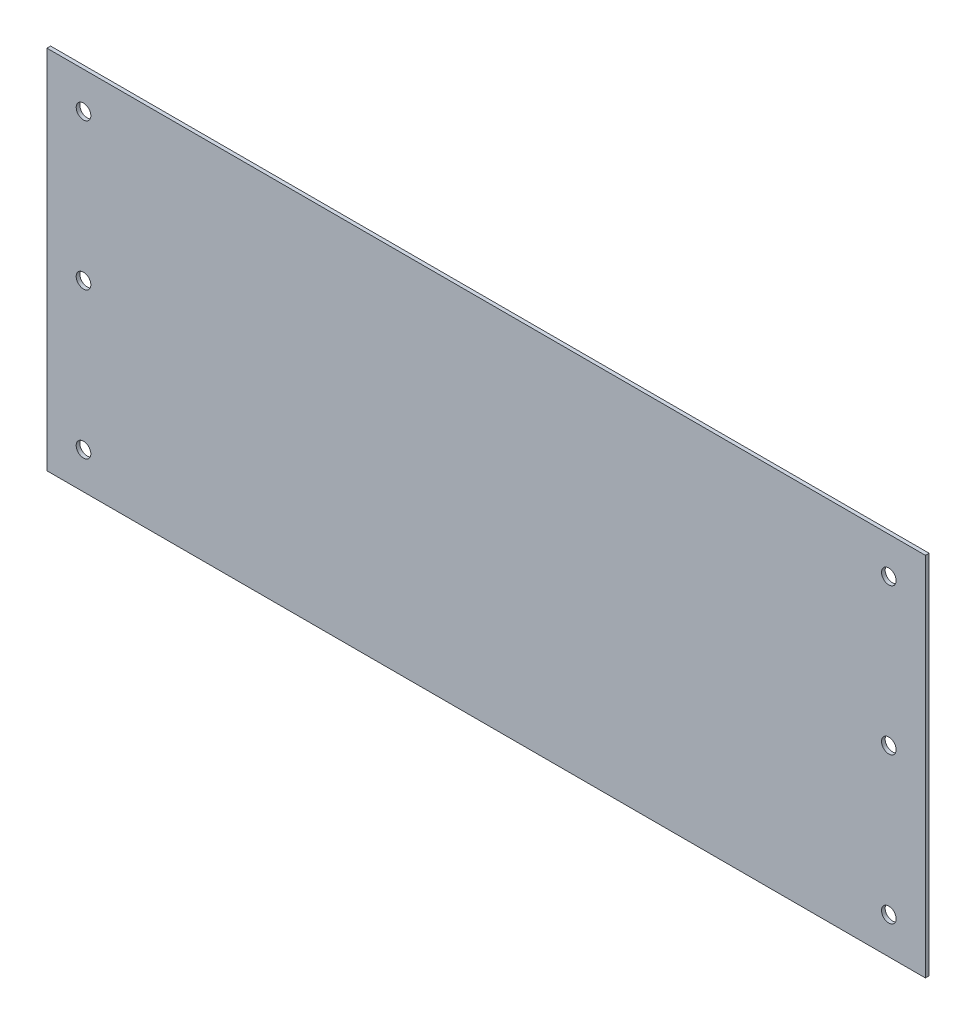
ISO-10303-21;
HEADER;
FILE_DESCRIPTION(('STEP AP214'),'2;1');
FILE_NAME('part.step','',(''),(''),'','','');
FILE_SCHEMA(('AUTOMOTIVE_DESIGN { 1 0 10303 214 1 1 1 1 }'));
ENDSEC;
DATA;
#1=APPLICATION_CONTEXT('core data for automotive mechanical design processes');
#2=APPLICATION_PROTOCOL_DEFINITION('international standard','automotive_design',2000,#1);
#3=PRODUCT_CONTEXT('',#1,'mechanical');
#4=PRODUCT('Part','Part','',(#3));
#5=PRODUCT_RELATED_PRODUCT_CATEGORY('part','',(#4));
#6=PRODUCT_DEFINITION_FORMATION('','',#4);
#7=PRODUCT_DEFINITION_CONTEXT('part definition',#1,'design');
#8=PRODUCT_DEFINITION('design','',#6,#7);
#9=PRODUCT_DEFINITION_SHAPE('','',#8);
#10=(LENGTH_UNIT() NAMED_UNIT(*) SI_UNIT(.MILLI.,.METRE.));
#11=(NAMED_UNIT(*) PLANE_ANGLE_UNIT() SI_UNIT($,.RADIAN.));
#12=(NAMED_UNIT(*) SI_UNIT($,.STERADIAN.) SOLID_ANGLE_UNIT());
#13=UNCERTAINTY_MEASURE_WITH_UNIT(LENGTH_MEASURE(1.E-05),#10,'distance_accuracy_value','');
#14=(GEOMETRIC_REPRESENTATION_CONTEXT(3) GLOBAL_UNCERTAINTY_ASSIGNED_CONTEXT((#13)) GLOBAL_UNIT_ASSIGNED_CONTEXT((#10,
#11,#12)) REPRESENTATION_CONTEXT('',''));
#15=CARTESIAN_POINT('',(0.,0.,0.));
#16=DIRECTION('',(0.,0.,1.));
#17=DIRECTION('',(1.,0.,0.));
#18=AXIS2_PLACEMENT_3D('',#15,#16,#17);
#19=CARTESIAN_POINT('',(-220.,100.,1.));
#20=DIRECTION('',(1.,0.,0.));
#21=DIRECTION('',(0.,0.,-1.));
#22=AXIS2_PLACEMENT_3D('',#19,#20,#21);
#23=PLANE('',#22);
#24=DIRECTION('',(0.,-1.,0.));
#25=VECTOR('',#24,1.);
#26=CARTESIAN_POINT('',(-220.,100.,0.));
#27=LINE('',#26,#25);
#28=CARTESIAN_POINT('',(-220.,100.,0.));
#29=VERTEX_POINT('',#28);
#30=CARTESIAN_POINT('',(-220.,0.,0.));
#31=VERTEX_POINT('',#30);
#32=EDGE_CURVE('E104',#29,#31,#27,.T.);
#33=ORIENTED_EDGE('',*,*,#32,.T.);
#34=DIRECTION('',(0.,0.,-1.));
#35=VECTOR('',#34,1.);
#36=CARTESIAN_POINT('',(-220.,0.,1.));
#37=LINE('',#36,#35);
#38=CARTESIAN_POINT('',(-220.,0.,1.));
#39=VERTEX_POINT('',#38);
#40=EDGE_CURVE('E11',#39,#31,#37,.T.);
#41=ORIENTED_EDGE('',*,*,#40,.F.);
#42=DIRECTION('',(0.,-1.,0.));
#43=VECTOR('',#42,1.);
#44=CARTESIAN_POINT('',(-220.,100.,1.));
#45=LINE('',#44,#43);
#46=CARTESIAN_POINT('',(-220.,100.,1.));
#47=VERTEX_POINT('',#46);
#48=EDGE_CURVE('E92',#47,#39,#45,.T.);
#49=ORIENTED_EDGE('',*,*,#48,.F.);
#50=DIRECTION('',(0.,0.,-1.));
#51=VECTOR('',#50,1.);
#52=CARTESIAN_POINT('',(-220.,100.,1.));
#53=LINE('',#52,#51);
#54=EDGE_CURVE('E100',#47,#29,#53,.T.);
#55=ORIENTED_EDGE('',*,*,#54,.T.);
#56=EDGE_LOOP('',(#33,#41,#49,#55));
#57=FACE_BOUND('',#56,.T.);
#58=ADVANCED_FACE('F41',(#57),#23,.F.);
#59=CARTESIAN_POINT('',(-220.,0.,1.));
#60=DIRECTION('',(0.,1.,0.));
#61=DIRECTION('',(0.,0.,1.));
#62=AXIS2_PLACEMENT_3D('',#59,#60,#61);
#63=PLANE('',#62);
#64=DIRECTION('',(1.,0.,0.));
#65=VECTOR('',#64,1.);
#66=CARTESIAN_POINT('',(-220.,0.,0.));
#67=LINE('',#66,#65);
#68=CARTESIAN_POINT('',(20.,0.,0.));
#69=VERTEX_POINT('',#68);
#70=EDGE_CURVE('E96',#31,#69,#67,.T.);
#71=ORIENTED_EDGE('',*,*,#70,.T.);
#72=DIRECTION('',(0.,0.,-1.));
#73=VECTOR('',#72,1.);
#74=CARTESIAN_POINT('',(20.,0.,1.));
#75=LINE('',#74,#73);
#76=CARTESIAN_POINT('',(20.,0.,1.));
#77=VERTEX_POINT('',#76);
#78=EDGE_CURVE('E49',#77,#69,#75,.T.);
#79=ORIENTED_EDGE('',*,*,#78,.F.);
#80=DIRECTION('',(1.,0.,0.));
#81=VECTOR('',#80,1.);
#82=CARTESIAN_POINT('',(-220.,0.,1.));
#83=LINE('',#82,#81);
#84=EDGE_CURVE('E87',#39,#77,#83,.T.);
#85=ORIENTED_EDGE('',*,*,#84,.F.);
#86=ORIENTED_EDGE('',*,*,#40,.T.);
#87=EDGE_LOOP('',(#71,#79,#85,#86));
#88=FACE_BOUND('',#87,.T.);
#89=ADVANCED_FACE('F95',(#88),#63,.F.);
#90=CARTESIAN_POINT('',(20.,100.,1.));
#91=DIRECTION('',(-1.,0.,0.));
#92=DIRECTION('',(0.,0.,1.));
#93=AXIS2_PLACEMENT_3D('',#90,#91,#92);
#94=PLANE('',#93);
#95=DIRECTION('',(0.,1.,0.));
#96=VECTOR('',#95,1.);
#97=CARTESIAN_POINT('',(20.,100.,0.));
#98=LINE('',#97,#96);
#99=CARTESIAN_POINT('',(20.,100.,0.));
#100=VERTEX_POINT('',#99);
#101=EDGE_CURVE('E74',#69,#100,#98,.T.);
#102=ORIENTED_EDGE('',*,*,#101,.T.);
#103=DIRECTION('',(0.,0.,-1.));
#104=VECTOR('',#103,1.);
#105=CARTESIAN_POINT('',(20.,100.,1.));
#106=LINE('',#105,#104);
#107=CARTESIAN_POINT('',(20.,100.,1.));
#108=VERTEX_POINT('',#107);
#109=EDGE_CURVE('E97',#108,#100,#106,.T.);
#110=ORIENTED_EDGE('',*,*,#109,.F.);
#111=DIRECTION('',(0.,1.,0.));
#112=VECTOR('',#111,1.);
#113=CARTESIAN_POINT('',(20.,100.,1.));
#114=LINE('',#113,#112);
#115=EDGE_CURVE('E90',#77,#108,#114,.T.);
#116=ORIENTED_EDGE('',*,*,#115,.F.);
#117=ORIENTED_EDGE('',*,*,#78,.T.);
#118=EDGE_LOOP('',(#102,#110,#116,#117));
#119=FACE_BOUND('',#118,.T.);
#120=ADVANCED_FACE('F98',(#119),#94,.F.);
#121=CARTESIAN_POINT('',(-220.,100.,1.));
#122=DIRECTION('',(0.,-1.,0.));
#123=DIRECTION('',(0.,0.,-1.));
#124=AXIS2_PLACEMENT_3D('',#121,#122,#123);
#125=PLANE('',#124);
#126=DIRECTION('',(-1.,0.,0.));
#127=VECTOR('',#126,1.);
#128=CARTESIAN_POINT('',(-220.,100.,0.));
#129=LINE('',#128,#127);
#130=EDGE_CURVE('E80',#100,#29,#129,.T.);
#131=ORIENTED_EDGE('',*,*,#130,.T.);
#132=ORIENTED_EDGE('',*,*,#54,.F.);
#133=DIRECTION('',(-1.,0.,0.));
#134=VECTOR('',#133,1.);
#135=CARTESIAN_POINT('',(-220.,100.,1.));
#136=LINE('',#135,#134);
#137=EDGE_CURVE('E57',#108,#47,#136,.T.);
#138=ORIENTED_EDGE('',*,*,#137,.F.);
#139=ORIENTED_EDGE('',*,*,#109,.T.);
#140=EDGE_LOOP('',(#131,#132,#138,#139));
#141=FACE_BOUND('',#140,.T.);
#142=ADVANCED_FACE('F112',(#141),#125,.F.);
#143=CARTESIAN_POINT('',(0.,0.,1.));
#144=DIRECTION('',(0.,0.,1.));
#145=DIRECTION('',(1.,0.,0.));
#146=AXIS2_PLACEMENT_3D('',#143,#144,#145);
#147=PLANE('',#146);
#148=CARTESIAN_POINT('',(-210.,90.,1.));
#149=DIRECTION('',(0.,0.,1.));
#150=DIRECTION('',(1.,0.,0.));
#151=AXIS2_PLACEMENT_3D('',#148,#149,#150);
#152=CIRCLE('',#151,2.00000000000003);
#153=CARTESIAN_POINT('',(-208.,90.,1.));
#154=VERTEX_POINT('',#153);
#155=EDGE_CURVE('E124',#154,#154,#152,.T.);
#156=ORIENTED_EDGE('',*,*,#155,.F.);
#157=EDGE_LOOP('',(#156));
#158=FACE_BOUND('',#157,.T.);
#159=CARTESIAN_POINT('',(-210.,50.,1.));
#160=DIRECTION('',(0.,0.,1.));
#161=DIRECTION('',(1.,0.,0.));
#162=AXIS2_PLACEMENT_3D('',#159,#160,#161);
#163=CIRCLE('',#162,1.99999999999997);
#164=CARTESIAN_POINT('',(-208.,50.,1.));
#165=VERTEX_POINT('',#164);
#166=EDGE_CURVE('E130',#165,#165,#163,.T.);
#167=ORIENTED_EDGE('',*,*,#166,.F.);
#168=EDGE_LOOP('',(#167));
#169=FACE_BOUND('',#168,.T.);
#170=CARTESIAN_POINT('',(-210.,10.,1.));
#171=DIRECTION('',(0.,0.,1.));
#172=DIRECTION('',(1.,0.,0.));
#173=AXIS2_PLACEMENT_3D('',#170,#171,#172);
#174=CIRCLE('',#173,2.);
#175=CARTESIAN_POINT('',(-208.,10.,1.));
#176=VERTEX_POINT('',#175);
#177=EDGE_CURVE('E136',#176,#176,#174,.T.);
#178=ORIENTED_EDGE('',*,*,#177,.F.);
#179=EDGE_LOOP('',(#178));
#180=FACE_BOUND('',#179,.T.);
#181=CARTESIAN_POINT('',(9.99999999999998,10.,1.));
#182=DIRECTION('',(0.,0.,1.));
#183=DIRECTION('',(1.,0.,0.));
#184=AXIS2_PLACEMENT_3D('',#181,#182,#183);
#185=CIRCLE('',#184,2.);
#186=CARTESIAN_POINT('',(12.,10.,1.));
#187=VERTEX_POINT('',#186);
#188=EDGE_CURVE('E142',#187,#187,#185,.T.);
#189=ORIENTED_EDGE('',*,*,#188,.F.);
#190=EDGE_LOOP('',(#189));
#191=FACE_BOUND('',#190,.T.);
#192=CARTESIAN_POINT('',(10.,50.,1.));
#193=DIRECTION('',(0.,0.,1.));
#194=DIRECTION('',(1.,0.,0.));
#195=AXIS2_PLACEMENT_3D('',#192,#193,#194);
#196=CIRCLE('',#195,2.);
#197=CARTESIAN_POINT('',(12.,50.,1.));
#198=VERTEX_POINT('',#197);
#199=EDGE_CURVE('E148',#198,#198,#196,.T.);
#200=ORIENTED_EDGE('',*,*,#199,.F.);
#201=EDGE_LOOP('',(#200));
#202=FACE_BOUND('',#201,.T.);
#203=CARTESIAN_POINT('',(9.99999999999999,90.,1.));
#204=DIRECTION('',(0.,0.,1.));
#205=DIRECTION('',(1.,0.,0.));
#206=AXIS2_PLACEMENT_3D('',#203,#204,#205);
#207=CIRCLE('',#206,2.);
#208=CARTESIAN_POINT('',(12.,90.,1.));
#209=VERTEX_POINT('',#208);
#210=EDGE_CURVE('E118',#209,#209,#207,.T.);
#211=ORIENTED_EDGE('',*,*,#210,.F.);
#212=EDGE_LOOP('',(#211));
#213=FACE_BOUND('',#212,.T.);
#214=ORIENTED_EDGE('',*,*,#48,.T.);
#215=ORIENTED_EDGE('',*,*,#84,.T.);
#216=ORIENTED_EDGE('',*,*,#115,.T.);
#217=ORIENTED_EDGE('',*,*,#137,.T.);
#218=EDGE_LOOP('',(#214,#215,#216,#217));
#219=FACE_BOUND('',#218,.T.);
#220=ADVANCED_FACE('F88',(#158,#169,#180,#191,#202,#213,#219),#147,.T.);
#221=CARTESIAN_POINT('',(0.,0.,0.));
#222=DIRECTION('',(0.,0.,1.));
#223=DIRECTION('',(1.,0.,0.));
#224=AXIS2_PLACEMENT_3D('',#221,#222,#223);
#225=PLANE('',#224);
#226=CARTESIAN_POINT('',(-210.,90.,0.));
#227=DIRECTION('',(0.,0.,1.));
#228=DIRECTION('',(1.,0.,0.));
#229=AXIS2_PLACEMENT_3D('',#226,#227,#228);
#230=CIRCLE('',#229,2.00000000000003);
#231=CARTESIAN_POINT('',(-208.,90.,0.));
#232=VERTEX_POINT('',#231);
#233=EDGE_CURVE('E127',#232,#232,#230,.T.);
#234=ORIENTED_EDGE('',*,*,#233,.T.);
#235=EDGE_LOOP('',(#234));
#236=FACE_BOUND('',#235,.T.);
#237=CARTESIAN_POINT('',(-210.,50.,0.));
#238=DIRECTION('',(0.,0.,1.));
#239=DIRECTION('',(1.,0.,0.));
#240=AXIS2_PLACEMENT_3D('',#237,#238,#239);
#241=CIRCLE('',#240,1.99999999999997);
#242=CARTESIAN_POINT('',(-208.,50.,0.));
#243=VERTEX_POINT('',#242);
#244=EDGE_CURVE('E133',#243,#243,#241,.T.);
#245=ORIENTED_EDGE('',*,*,#244,.T.);
#246=EDGE_LOOP('',(#245));
#247=FACE_BOUND('',#246,.T.);
#248=CARTESIAN_POINT('',(-210.,10.,0.));
#249=DIRECTION('',(0.,0.,1.));
#250=DIRECTION('',(1.,0.,0.));
#251=AXIS2_PLACEMENT_3D('',#248,#249,#250);
#252=CIRCLE('',#251,2.);
#253=CARTESIAN_POINT('',(-208.,10.,0.));
#254=VERTEX_POINT('',#253);
#255=EDGE_CURVE('E139',#254,#254,#252,.T.);
#256=ORIENTED_EDGE('',*,*,#255,.T.);
#257=EDGE_LOOP('',(#256));
#258=FACE_BOUND('',#257,.T.);
#259=CARTESIAN_POINT('',(9.99999999999998,10.,0.));
#260=DIRECTION('',(0.,0.,1.));
#261=DIRECTION('',(1.,0.,0.));
#262=AXIS2_PLACEMENT_3D('',#259,#260,#261);
#263=CIRCLE('',#262,2.);
#264=CARTESIAN_POINT('',(12.,10.,0.));
#265=VERTEX_POINT('',#264);
#266=EDGE_CURVE('E145',#265,#265,#263,.T.);
#267=ORIENTED_EDGE('',*,*,#266,.T.);
#268=EDGE_LOOP('',(#267));
#269=FACE_BOUND('',#268,.T.);
#270=CARTESIAN_POINT('',(10.,50.,0.));
#271=DIRECTION('',(0.,0.,1.));
#272=DIRECTION('',(1.,0.,0.));
#273=AXIS2_PLACEMENT_3D('',#270,#271,#272);
#274=CIRCLE('',#273,2.);
#275=CARTESIAN_POINT('',(12.,50.,0.));
#276=VERTEX_POINT('',#275);
#277=EDGE_CURVE('E121',#276,#276,#274,.T.);
#278=ORIENTED_EDGE('',*,*,#277,.T.);
#279=EDGE_LOOP('',(#278));
#280=FACE_BOUND('',#279,.T.);
#281=CARTESIAN_POINT('',(9.99999999999999,90.,0.));
#282=DIRECTION('',(0.,0.,1.));
#283=DIRECTION('',(1.,0.,0.));
#284=AXIS2_PLACEMENT_3D('',#281,#282,#283);
#285=CIRCLE('',#284,2.);
#286=CARTESIAN_POINT('',(12.,90.,0.));
#287=VERTEX_POINT('',#286);
#288=EDGE_CURVE('E107',#287,#287,#285,.T.);
#289=ORIENTED_EDGE('',*,*,#288,.T.);
#290=EDGE_LOOP('',(#289));
#291=FACE_BOUND('',#290,.T.);
#292=ORIENTED_EDGE('',*,*,#32,.F.);
#293=ORIENTED_EDGE('',*,*,#130,.F.);
#294=ORIENTED_EDGE('',*,*,#101,.F.);
#295=ORIENTED_EDGE('',*,*,#70,.F.);
#296=EDGE_LOOP('',(#292,#293,#294,#295));
#297=FACE_BOUND('',#296,.T.);
#298=ADVANCED_FACE('F115',(#236,#247,#258,#269,#280,#291,#297),#225,.F.);
#299=CARTESIAN_POINT('',(9.99999999999999,90.,0.));
#300=DIRECTION('',(0.,0.,1.));
#301=DIRECTION('',(1.,0.,0.));
#302=AXIS2_PLACEMENT_3D('',#299,#300,#301);
#303=CYLINDRICAL_SURFACE('',#302,2.);
#304=ORIENTED_EDGE('',*,*,#288,.F.);
#305=EDGE_LOOP('',(#304));
#306=FACE_BOUND('',#305,.T.);
#307=ORIENTED_EDGE('',*,*,#210,.T.);
#308=EDGE_LOOP('',(#307));
#309=FACE_BOUND('',#308,.T.);
#310=ADVANCED_FACE('F160',(#306,#309),#303,.F.);
#311=CARTESIAN_POINT('',(10.,50.,0.));
#312=DIRECTION('',(0.,0.,1.));
#313=DIRECTION('',(1.,0.,0.));
#314=AXIS2_PLACEMENT_3D('',#311,#312,#313);
#315=CYLINDRICAL_SURFACE('',#314,2.);
#316=ORIENTED_EDGE('',*,*,#277,.F.);
#317=EDGE_LOOP('',(#316));
#318=FACE_BOUND('',#317,.T.);
#319=ORIENTED_EDGE('',*,*,#199,.T.);
#320=EDGE_LOOP('',(#319));
#321=FACE_BOUND('',#320,.T.);
#322=ADVANCED_FACE('F156',(#318,#321),#315,.F.);
#323=CARTESIAN_POINT('',(9.99999999999998,10.,0.));
#324=DIRECTION('',(0.,0.,1.));
#325=DIRECTION('',(1.,0.,0.));
#326=AXIS2_PLACEMENT_3D('',#323,#324,#325);
#327=CYLINDRICAL_SURFACE('',#326,2.);
#328=ORIENTED_EDGE('',*,*,#266,.F.);
#329=EDGE_LOOP('',(#328));
#330=FACE_BOUND('',#329,.T.);
#331=ORIENTED_EDGE('',*,*,#188,.T.);
#332=EDGE_LOOP('',(#331));
#333=FACE_BOUND('',#332,.T.);
#334=ADVANCED_FACE('F159',(#330,#333),#327,.F.);
#335=CARTESIAN_POINT('',(-210.,10.,0.));
#336=DIRECTION('',(0.,0.,1.));
#337=DIRECTION('',(1.,0.,0.));
#338=AXIS2_PLACEMENT_3D('',#335,#336,#337);
#339=CYLINDRICAL_SURFACE('',#338,2.);
#340=ORIENTED_EDGE('',*,*,#255,.F.);
#341=EDGE_LOOP('',(#340));
#342=FACE_BOUND('',#341,.T.);
#343=ORIENTED_EDGE('',*,*,#177,.T.);
#344=EDGE_LOOP('',(#343));
#345=FACE_BOUND('',#344,.T.);
#346=ADVANCED_FACE('F223',(#342,#345),#339,.F.);
#347=CARTESIAN_POINT('',(-210.,50.,0.));
#348=DIRECTION('',(0.,0.,1.));
#349=DIRECTION('',(1.,0.,0.));
#350=AXIS2_PLACEMENT_3D('',#347,#348,#349);
#351=CYLINDRICAL_SURFACE('',#350,1.99999999999997);
#352=ORIENTED_EDGE('',*,*,#244,.F.);
#353=EDGE_LOOP('',(#352));
#354=FACE_BOUND('',#353,.T.);
#355=ORIENTED_EDGE('',*,*,#166,.T.);
#356=EDGE_LOOP('',(#355));
#357=FACE_BOUND('',#356,.T.);
#358=ADVANCED_FACE('F233',(#354,#357),#351,.F.);
#359=CARTESIAN_POINT('',(-210.,90.,0.));
#360=DIRECTION('',(0.,0.,1.));
#361=DIRECTION('',(1.,0.,0.));
#362=AXIS2_PLACEMENT_3D('',#359,#360,#361);
#363=CYLINDRICAL_SURFACE('',#362,2.00000000000003);
#364=ORIENTED_EDGE('',*,*,#233,.F.);
#365=EDGE_LOOP('',(#364));
#366=FACE_BOUND('',#365,.T.);
#367=ORIENTED_EDGE('',*,*,#155,.T.);
#368=EDGE_LOOP('',(#367));
#369=FACE_BOUND('',#368,.T.);
#370=ADVANCED_FACE('F243',(#366,#369),#363,.F.);
#371=CLOSED_SHELL('',(#58,#89,#120,#142,#220,#298,#310,#322,#334,#346,#358,#370));
#372=MANIFOLD_SOLID_BREP('B2',#371);
#373=ADVANCED_BREP_SHAPE_REPRESENTATION('',(#18,#372),#14);
#374=SHAPE_DEFINITION_REPRESENTATION(#9,#373);
ENDSEC;
END-ISO-10303-21;
